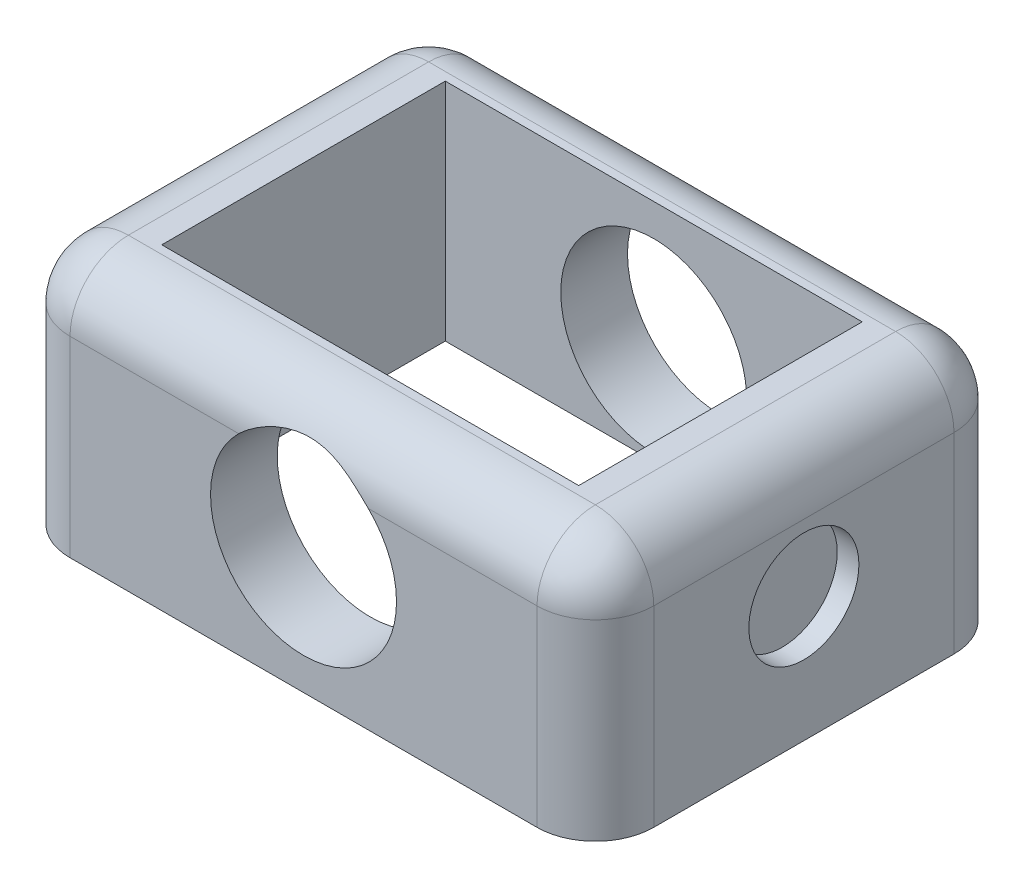
ISO-10303-21;
HEADER;
FILE_DESCRIPTION(('STEP AP214'),'2;1');
FILE_NAME('part.step','',(''),(''),'','','');
FILE_SCHEMA(('AUTOMOTIVE_DESIGN { 1 0 10303 214 1 1 1 1 }'));
ENDSEC;
DATA;
#1=APPLICATION_CONTEXT('core data for automotive mechanical design processes');
#2=APPLICATION_PROTOCOL_DEFINITION('international standard','automotive_design',2000,#1);
#3=PRODUCT_CONTEXT('',#1,'mechanical');
#4=PRODUCT('Part','Part','',(#3));
#5=PRODUCT_RELATED_PRODUCT_CATEGORY('part','',(#4));
#6=PRODUCT_DEFINITION_FORMATION('','',#4);
#7=PRODUCT_DEFINITION_CONTEXT('part definition',#1,'design');
#8=PRODUCT_DEFINITION('design','',#6,#7);
#9=PRODUCT_DEFINITION_SHAPE('','',#8);
#10=(LENGTH_UNIT() NAMED_UNIT(*) SI_UNIT(.MILLI.,.METRE.));
#11=(NAMED_UNIT(*) PLANE_ANGLE_UNIT() SI_UNIT($,.RADIAN.));
#12=(NAMED_UNIT(*) SI_UNIT($,.STERADIAN.) SOLID_ANGLE_UNIT());
#13=UNCERTAINTY_MEASURE_WITH_UNIT(LENGTH_MEASURE(1.E-05),#10,'distance_accuracy_value','');
#14=(GEOMETRIC_REPRESENTATION_CONTEXT(3) GLOBAL_UNCERTAINTY_ASSIGNED_CONTEXT((#13)) GLOBAL_UNIT_ASSIGNED_CONTEXT((#10,
#11,#12)) REPRESENTATION_CONTEXT('',''));
#15=CARTESIAN_POINT('',(0.,0.,0.));
#16=DIRECTION('',(0.,0.,1.));
#17=DIRECTION('',(1.,0.,0.));
#18=AXIS2_PLACEMENT_3D('',#15,#16,#17);
#19=CARTESIAN_POINT('',(35.,15.,25.));
#20=DIRECTION('',(-1.,0.,0.));
#21=DIRECTION('',(0.,0.,1.));
#22=AXIS2_PLACEMENT_3D('',#19,#20,#21);
#23=PLANE('',#22);
#24=CARTESIAN_POINT('',(35.,0.,0.));
#25=DIRECTION('',(1.,0.,0.));
#26=DIRECTION('',(0.,0.,-1.));
#27=AXIS2_PLACEMENT_3D('',#24,#25,#26);
#28=CIRCLE('',#27,6.6);
#29=CARTESIAN_POINT('',(35.,0.,-6.6));
#30=VERTEX_POINT('',#29);
#31=EDGE_CURVE('E699',#30,#30,#28,.T.);
#32=ORIENTED_EDGE('',*,*,#31,.F.);
#33=EDGE_LOOP('',(#32));
#34=FACE_BOUND('',#33,.T.);
#35=DIRECTION('',(0.,0.,-1.));
#36=VECTOR('',#35,1.);
#37=CARTESIAN_POINT('',(35.,8.,25.));
#38=LINE('',#37,#36);
#39=CARTESIAN_POINT('',(35.,8.,-18.));
#40=VERTEX_POINT('',#39);
#41=CARTESIAN_POINT('',(35.,8.,18.));
#42=VERTEX_POINT('',#41);
#43=EDGE_CURVE('E205',#40,#42,#38,.F.);
#44=ORIENTED_EDGE('',*,*,#43,.T.);
#45=DIRECTION('',(0.,-1.,0.));
#46=VECTOR('',#45,1.);
#47=CARTESIAN_POINT('',(35.,15.,18.));
#48=LINE('',#47,#46);
#49=CARTESIAN_POINT('',(35.,-15.,18.));
#50=VERTEX_POINT('',#49);
#51=EDGE_CURVE('E209',#42,#50,#48,.T.);
#52=ORIENTED_EDGE('',*,*,#51,.T.);
#53=DIRECTION('',(0.,0.,-1.));
#54=VECTOR('',#53,1.);
#55=CARTESIAN_POINT('',(35.,-15.,25.));
#56=LINE('',#55,#54);
#57=CARTESIAN_POINT('',(35.,-15.,-18.));
#58=VERTEX_POINT('',#57);
#59=EDGE_CURVE('E324',#50,#58,#56,.T.);
#60=ORIENTED_EDGE('',*,*,#59,.T.);
#61=DIRECTION('',(0.,-1.,0.));
#62=VECTOR('',#61,1.);
#63=CARTESIAN_POINT('',(35.,15.,-18.));
#64=LINE('',#63,#62);
#65=EDGE_CURVE('E207',#58,#40,#64,.F.);
#66=ORIENTED_EDGE('',*,*,#65,.T.);
#67=EDGE_LOOP('',(#44,#52,#60,#66));
#68=FACE_BOUND('',#67,.T.);
#69=ADVANCED_FACE('F33',(#34,#68),#23,.F.);
#70=CARTESIAN_POINT('',(-35.,15.,-25.));
#71=DIRECTION('',(0.,0.,1.));
#72=DIRECTION('',(1.,0.,0.));
#73=AXIS2_PLACEMENT_3D('',#70,#71,#72);
#74=PLANE('',#73);
#75=DIRECTION('',(-1.,0.,0.));
#76=VECTOR('',#75,1.);
#77=CARTESIAN_POINT('',(-35.,8.,-25.));
#78=LINE('',#77,#76);
#79=CARTESIAN_POINT('',(-28.,8.,-25.));
#80=VERTEX_POINT('',#79);
#81=CARTESIAN_POINT('',(-7.76675607959977,8.,-25.));
#82=VERTEX_POINT('',#81);
#83=EDGE_CURVE('E212',#80,#82,#78,.F.);
#84=ORIENTED_EDGE('',*,*,#83,.T.);
#85=CARTESIAN_POINT('',(0.,0.,-25.));
#86=DIRECTION('',(0.,0.,1.));
#87=DIRECTION('',(1.,0.,0.));
#88=AXIS2_PLACEMENT_3D('',#85,#86,#87);
#89=CIRCLE('',#88,11.15);
#90=CARTESIAN_POINT('',(7.76675607959977,8.,-25.));
#91=VERTEX_POINT('',#90);
#92=EDGE_CURVE('E53',#82,#91,#89,.T.);
#93=ORIENTED_EDGE('',*,*,#92,.T.);
#94=CARTESIAN_POINT('',(28.,8.,-25.));
#95=VERTEX_POINT('',#94);
#96=EDGE_CURVE('E211',#91,#95,#78,.F.);
#97=ORIENTED_EDGE('',*,*,#96,.T.);
#98=DIRECTION('',(0.,-1.,0.));
#99=VECTOR('',#98,1.);
#100=CARTESIAN_POINT('',(28.,15.,-25.));
#101=LINE('',#100,#99);
#102=CARTESIAN_POINT('',(28.,-15.,-25.));
#103=VERTEX_POINT('',#102);
#104=EDGE_CURVE('E217',#95,#103,#101,.T.);
#105=ORIENTED_EDGE('',*,*,#104,.T.);
#106=DIRECTION('',(-1.,0.,0.));
#107=VECTOR('',#106,1.);
#108=CARTESIAN_POINT('',(-35.,-15.,-25.));
#109=LINE('',#108,#107);
#110=CARTESIAN_POINT('',(-28.,-15.,-25.));
#111=VERTEX_POINT('',#110);
#112=EDGE_CURVE('E327',#103,#111,#109,.T.);
#113=ORIENTED_EDGE('',*,*,#112,.T.);
#114=DIRECTION('',(0.,-1.,0.));
#115=VECTOR('',#114,1.);
#116=CARTESIAN_POINT('',(-28.,15.,-25.));
#117=LINE('',#116,#115);
#118=EDGE_CURVE('E215',#111,#80,#117,.F.);
#119=ORIENTED_EDGE('',*,*,#118,.T.);
#120=EDGE_LOOP('',(#84,#93,#97,#105,#113,#119));
#121=FACE_BOUND('',#120,.T.);
#122=ADVANCED_FACE('F384',(#121),#74,.F.);
#123=CARTESIAN_POINT('',(-35.,15.,25.));
#124=DIRECTION('',(1.,0.,0.));
#125=DIRECTION('',(0.,0.,-1.));
#126=AXIS2_PLACEMENT_3D('',#123,#124,#125);
#127=PLANE('',#126);
#128=CARTESIAN_POINT('',(-35.,0.,0.));
#129=DIRECTION('',(1.,0.,0.));
#130=DIRECTION('',(0.,0.,-1.));
#131=AXIS2_PLACEMENT_3D('',#128,#129,#130);
#132=CIRCLE('',#131,6.6);
#133=CARTESIAN_POINT('',(-35.,0.,-6.6));
#134=VERTEX_POINT('',#133);
#135=EDGE_CURVE('E705',#134,#134,#132,.T.);
#136=ORIENTED_EDGE('',*,*,#135,.T.);
#137=EDGE_LOOP('',(#136));
#138=FACE_BOUND('',#137,.T.);
#139=DIRECTION('',(0.,0.,1.));
#140=VECTOR('',#139,1.);
#141=CARTESIAN_POINT('',(-35.,-15.,25.));
#142=LINE('',#141,#140);
#143=CARTESIAN_POINT('',(-35.,-15.,-18.));
#144=VERTEX_POINT('',#143);
#145=CARTESIAN_POINT('',(-35.,-15.,18.));
#146=VERTEX_POINT('',#145);
#147=EDGE_CURVE('E184',#144,#146,#142,.T.);
#148=ORIENTED_EDGE('',*,*,#147,.T.);
#149=DIRECTION('',(0.,-1.,0.));
#150=VECTOR('',#149,1.);
#151=CARTESIAN_POINT('',(-35.,15.,18.));
#152=LINE('',#151,#150);
#153=CARTESIAN_POINT('',(-35.,8.,18.));
#154=VERTEX_POINT('',#153);
#155=EDGE_CURVE('E203',#146,#154,#152,.F.);
#156=ORIENTED_EDGE('',*,*,#155,.T.);
#157=DIRECTION('',(0.,0.,1.));
#158=VECTOR('',#157,1.);
#159=CARTESIAN_POINT('',(-35.,8.,25.));
#160=LINE('',#159,#158);
#161=CARTESIAN_POINT('',(-35.,8.,-18.));
#162=VERTEX_POINT('',#161);
#163=EDGE_CURVE('E199',#154,#162,#160,.F.);
#164=ORIENTED_EDGE('',*,*,#163,.T.);
#165=DIRECTION('',(0.,-1.,0.));
#166=VECTOR('',#165,1.);
#167=CARTESIAN_POINT('',(-35.,15.,-18.));
#168=LINE('',#167,#166);
#169=EDGE_CURVE('E201',#162,#144,#168,.T.);
#170=ORIENTED_EDGE('',*,*,#169,.T.);
#171=EDGE_LOOP('',(#148,#156,#164,#170));
#172=FACE_BOUND('',#171,.T.);
#173=ADVANCED_FACE('F344',(#138,#172),#127,.F.);
#174=CARTESIAN_POINT('',(-35.,15.,25.));
#175=DIRECTION('',(0.,0.,-1.));
#176=DIRECTION('',(-1.,0.,0.));
#177=AXIS2_PLACEMENT_3D('',#174,#175,#176);
#178=PLANE('',#177);
#179=DIRECTION('',(1.,0.,0.));
#180=VECTOR('',#179,1.);
#181=CARTESIAN_POINT('',(-35.,8.,25.));
#182=LINE('',#181,#180);
#183=CARTESIAN_POINT('',(28.,8.,25.));
#184=VERTEX_POINT('',#183);
#185=CARTESIAN_POINT('',(7.76675607959977,8.,25.));
#186=VERTEX_POINT('',#185);
#187=EDGE_CURVE('E171',#184,#186,#182,.F.);
#188=ORIENTED_EDGE('',*,*,#187,.T.);
#189=CARTESIAN_POINT('',(0.,0.,25.));
#190=DIRECTION('',(0.,0.,-1.));
#191=DIRECTION('',(-1.,0.,0.));
#192=AXIS2_PLACEMENT_3D('',#189,#190,#191);
#193=CIRCLE('',#192,11.15);
#194=CARTESIAN_POINT('',(-7.76675607959977,8.,25.));
#195=VERTEX_POINT('',#194);
#196=EDGE_CURVE('E59',#186,#195,#193,.T.);
#197=ORIENTED_EDGE('',*,*,#196,.T.);
#198=CARTESIAN_POINT('',(-28.,8.,25.));
#199=VERTEX_POINT('',#198);
#200=EDGE_CURVE('E169',#195,#199,#182,.F.);
#201=ORIENTED_EDGE('',*,*,#200,.T.);
#202=DIRECTION('',(0.,-1.,0.));
#203=VECTOR('',#202,1.);
#204=CARTESIAN_POINT('',(-28.,15.,25.));
#205=LINE('',#204,#203);
#206=CARTESIAN_POINT('',(-28.,-15.,25.));
#207=VERTEX_POINT('',#206);
#208=EDGE_CURVE('E189',#199,#207,#205,.T.);
#209=ORIENTED_EDGE('',*,*,#208,.T.);
#210=DIRECTION('',(1.,0.,0.));
#211=VECTOR('',#210,1.);
#212=CARTESIAN_POINT('',(-35.,-15.,25.));
#213=LINE('',#212,#211);
#214=CARTESIAN_POINT('',(28.,-15.,25.));
#215=VERTEX_POINT('',#214);
#216=EDGE_CURVE('E180',#207,#215,#213,.T.);
#217=ORIENTED_EDGE('',*,*,#216,.T.);
#218=DIRECTION('',(0.,-1.,0.));
#219=VECTOR('',#218,1.);
#220=CARTESIAN_POINT('',(28.,15.,25.));
#221=LINE('',#220,#219);
#222=EDGE_CURVE('E182',#215,#184,#221,.F.);
#223=ORIENTED_EDGE('',*,*,#222,.T.);
#224=EDGE_LOOP('',(#188,#197,#201,#209,#217,#223));
#225=FACE_BOUND('',#224,.T.);
#226=ADVANCED_FACE('F167',(#225),#178,.F.);
#227=CARTESIAN_POINT('',(0.,15.,0.));
#228=DIRECTION('',(0.,-1.,0.));
#229=DIRECTION('',(0.,0.,-1.));
#230=AXIS2_PLACEMENT_3D('',#227,#228,#229);
#231=PLANE('',#230);
#232=DIRECTION('',(0.,0.,-1.));
#233=VECTOR('',#232,1.);
#234=CARTESIAN_POINT('',(28.,15.,0.));
#235=LINE('',#234,#233);
#236=CARTESIAN_POINT('',(28.,15.,18.));
#237=VERTEX_POINT('',#236);
#238=CARTESIAN_POINT('',(28.,15.,-18.));
#239=VERTEX_POINT('',#238);
#240=EDGE_CURVE('E223',#237,#239,#235,.T.);
#241=ORIENTED_EDGE('',*,*,#240,.T.);
#242=DIRECTION('',(-1.,0.,0.));
#243=VECTOR('',#242,1.);
#244=CARTESIAN_POINT('',(0.,15.,-18.));
#245=LINE('',#244,#243);
#246=CARTESIAN_POINT('',(-28.,15.,-18.));
#247=VERTEX_POINT('',#246);
#248=EDGE_CURVE('E225',#239,#247,#245,.T.);
#249=ORIENTED_EDGE('',*,*,#248,.T.);
#250=DIRECTION('',(0.,0.,1.));
#251=VECTOR('',#250,1.);
#252=CARTESIAN_POINT('',(-28.,15.,0.));
#253=LINE('',#252,#251);
#254=CARTESIAN_POINT('',(-28.,15.,18.));
#255=VERTEX_POINT('',#254);
#256=EDGE_CURVE('E221',#247,#255,#253,.T.);
#257=ORIENTED_EDGE('',*,*,#256,.T.);
#258=DIRECTION('',(1.,0.,0.));
#259=VECTOR('',#258,1.);
#260=CARTESIAN_POINT('',(0.,15.,18.));
#261=LINE('',#260,#259);
#262=EDGE_CURVE('E219',#255,#237,#261,.T.);
#263=ORIENTED_EDGE('',*,*,#262,.T.);
#264=EDGE_LOOP('',(#241,#249,#257,#263));
#265=FACE_BOUND('',#264,.T.);
#266=DIRECTION('',(1.,0.,0.));
#267=VECTOR('',#266,1.);
#268=CARTESIAN_POINT('',(-25.,15.,-17.));
#269=LINE('',#268,#267);
#270=CARTESIAN_POINT('',(-25.,15.,-17.));
#271=VERTEX_POINT('',#270);
#272=CARTESIAN_POINT('',(25.,15.,-17.));
#273=VERTEX_POINT('',#272);
#274=EDGE_CURVE('E332',#271,#273,#269,.T.);
#275=ORIENTED_EDGE('',*,*,#274,.T.);
#276=DIRECTION('',(0.,0.,1.));
#277=VECTOR('',#276,1.);
#278=CARTESIAN_POINT('',(25.,15.,-17.));
#279=LINE('',#278,#277);
#280=CARTESIAN_POINT('',(25.,15.,17.));
#281=VERTEX_POINT('',#280);
#282=EDGE_CURVE('E264',#273,#281,#279,.T.);
#283=ORIENTED_EDGE('',*,*,#282,.T.);
#284=DIRECTION('',(-1.,0.,0.));
#285=VECTOR('',#284,1.);
#286=CARTESIAN_POINT('',(-25.,15.,17.));
#287=LINE('',#286,#285);
#288=CARTESIAN_POINT('',(-25.,15.,17.));
#289=VERTEX_POINT('',#288);
#290=EDGE_CURVE('E689',#281,#289,#287,.T.);
#291=ORIENTED_EDGE('',*,*,#290,.T.);
#292=DIRECTION('',(0.,0.,-1.));
#293=VECTOR('',#292,1.);
#294=CARTESIAN_POINT('',(-25.,15.,-17.));
#295=LINE('',#294,#293);
#296=EDGE_CURVE('E691',#289,#271,#295,.T.);
#297=ORIENTED_EDGE('',*,*,#296,.T.);
#298=EDGE_LOOP('',(#275,#283,#291,#297));
#299=FACE_BOUND('',#298,.T.);
#300=ADVANCED_FACE('F369',(#265,#299),#231,.F.);
#301=CARTESIAN_POINT('',(0.,-15.,0.));
#302=DIRECTION('',(0.,-1.,0.));
#303=DIRECTION('',(0.,0.,-1.));
#304=AXIS2_PLACEMENT_3D('',#301,#302,#303);
#305=PLANE('',#304);
#306=DIRECTION('',(0.,0.,-1.));
#307=VECTOR('',#306,1.);
#308=CARTESIAN_POINT('',(28.,-15.,-17.));
#309=LINE('',#308,#307);
#310=CARTESIAN_POINT('',(28.,-15.,20.));
#311=VERTEX_POINT('',#310);
#312=CARTESIAN_POINT('',(28.,-15.,-20.));
#313=VERTEX_POINT('',#312);
#314=EDGE_CURVE('E267',#311,#313,#309,.T.);
#315=ORIENTED_EDGE('',*,*,#314,.T.);
#316=DIRECTION('',(-1.,0.,0.));
#317=VECTOR('',#316,1.);
#318=CARTESIAN_POINT('',(-25.,-15.,-20.));
#319=LINE('',#318,#317);
#320=CARTESIAN_POINT('',(-28.,-15.,-20.));
#321=VERTEX_POINT('',#320);
#322=EDGE_CURVE('E273',#313,#321,#319,.T.);
#323=ORIENTED_EDGE('',*,*,#322,.T.);
#324=DIRECTION('',(0.,0.,1.));
#325=VECTOR('',#324,1.);
#326=CARTESIAN_POINT('',(-28.,-15.,17.));
#327=LINE('',#326,#325);
#328=CARTESIAN_POINT('',(-28.,-15.,20.));
#329=VERTEX_POINT('',#328);
#330=EDGE_CURVE('E271',#321,#329,#327,.T.);
#331=ORIENTED_EDGE('',*,*,#330,.T.);
#332=DIRECTION('',(1.,0.,0.));
#333=VECTOR('',#332,1.);
#334=CARTESIAN_POINT('',(25.,-15.,20.));
#335=LINE('',#334,#333);
#336=EDGE_CURVE('E269',#329,#311,#335,.T.);
#337=ORIENTED_EDGE('',*,*,#336,.T.);
#338=EDGE_LOOP('',(#315,#323,#331,#337));
#339=FACE_BOUND('',#338,.T.);
#340=ORIENTED_EDGE('',*,*,#216,.F.);
#341=CARTESIAN_POINT('',(-28.,-15.,18.));
#342=DIRECTION('',(0.,-1.,0.));
#343=DIRECTION('',(0.,0.,-1.));
#344=AXIS2_PLACEMENT_3D('',#341,#342,#343);
#345=CIRCLE('',#344,7.);
#346=EDGE_CURVE('E197',#207,#146,#345,.T.);
#347=ORIENTED_EDGE('',*,*,#346,.T.);
#348=ORIENTED_EDGE('',*,*,#147,.F.);
#349=CARTESIAN_POINT('',(-28.,-15.,-18.));
#350=DIRECTION('',(0.,-1.,0.));
#351=DIRECTION('',(0.,0.,-1.));
#352=AXIS2_PLACEMENT_3D('',#349,#350,#351);
#353=CIRCLE('',#352,7.);
#354=EDGE_CURVE('E191',#144,#111,#353,.T.);
#355=ORIENTED_EDGE('',*,*,#354,.T.);
#356=ORIENTED_EDGE('',*,*,#112,.F.);
#357=CARTESIAN_POINT('',(28.,-15.,-18.));
#358=DIRECTION('',(0.,-1.,0.));
#359=DIRECTION('',(0.,0.,-1.));
#360=AXIS2_PLACEMENT_3D('',#357,#358,#359);
#361=CIRCLE('',#360,7.);
#362=EDGE_CURVE('E193',#103,#58,#361,.T.);
#363=ORIENTED_EDGE('',*,*,#362,.T.);
#364=ORIENTED_EDGE('',*,*,#59,.F.);
#365=CARTESIAN_POINT('',(28.,-15.,18.));
#366=DIRECTION('',(0.,-1.,0.));
#367=DIRECTION('',(0.,0.,-1.));
#368=AXIS2_PLACEMENT_3D('',#365,#366,#367);
#369=CIRCLE('',#368,7.);
#370=EDGE_CURVE('E195',#50,#215,#369,.T.);
#371=ORIENTED_EDGE('',*,*,#370,.T.);
#372=EDGE_LOOP('',(#340,#347,#348,#355,#356,#363,#364,#371));
#373=FACE_BOUND('',#372,.T.);
#374=ADVANCED_FACE('F301',(#339,#373),#305,.T.);
#375=CARTESIAN_POINT('',(25.,15.,-17.));
#376=DIRECTION('',(1.,0.,0.));
#377=DIRECTION('',(0.,0.,-1.));
#378=AXIS2_PLACEMENT_3D('',#375,#376,#377);
#379=PLANE('',#378);
#380=DIRECTION('',(0.,-1.,0.));
#381=VECTOR('',#380,1.);
#382=CARTESIAN_POINT('',(25.,15.,-17.));
#383=LINE('',#382,#381);
#384=CARTESIAN_POINT('',(25.,-12.,-17.));
#385=VERTEX_POINT('',#384);
#386=EDGE_CURVE('E318',#273,#385,#383,.T.);
#387=ORIENTED_EDGE('',*,*,#386,.T.);
#388=DIRECTION('',(0.,0.,1.));
#389=VECTOR('',#388,1.);
#390=CARTESIAN_POINT('',(25.,-12.,17.));
#391=LINE('',#390,#389);
#392=CARTESIAN_POINT('',(25.,-12.,17.));
#393=VERTEX_POINT('',#392);
#394=EDGE_CURVE('E47',#385,#393,#391,.T.);
#395=ORIENTED_EDGE('',*,*,#394,.T.);
#396=DIRECTION('',(0.,-1.,0.));
#397=VECTOR('',#396,1.);
#398=CARTESIAN_POINT('',(25.,15.,17.));
#399=LINE('',#398,#397);
#400=EDGE_CURVE('E337',#281,#393,#399,.T.);
#401=ORIENTED_EDGE('',*,*,#400,.F.);
#402=ORIENTED_EDGE('',*,*,#282,.F.);
#403=EDGE_LOOP('',(#387,#395,#401,#402));
#404=FACE_BOUND('',#403,.T.);
#405=ADVANCED_FACE('F321',(#404),#379,.F.);
#406=CARTESIAN_POINT('',(-25.,15.,-17.));
#407=DIRECTION('',(0.,0.,-1.));
#408=DIRECTION('',(-1.,0.,0.));
#409=AXIS2_PLACEMENT_3D('',#406,#407,#408);
#410=PLANE('',#409);
#411=CARTESIAN_POINT('',(0.,0.,-17.));
#412=DIRECTION('',(0.,0.,-1.));
#413=DIRECTION('',(-1.,0.,0.));
#414=AXIS2_PLACEMENT_3D('',#411,#412,#413);
#415=CIRCLE('',#414,11.15);
#416=CARTESIAN_POINT('',(-11.15,0.,-17.));
#417=VERTEX_POINT('',#416);
#418=EDGE_CURVE('E284',#417,#417,#415,.T.);
#419=ORIENTED_EDGE('',*,*,#418,.T.);
#420=EDGE_LOOP('',(#419));
#421=FACE_BOUND('',#420,.T.);
#422=DIRECTION('',(0.,-1.,0.));
#423=VECTOR('',#422,1.);
#424=CARTESIAN_POINT('',(-25.,15.,-17.));
#425=LINE('',#424,#423);
#426=CARTESIAN_POINT('',(-25.,-12.,-17.));
#427=VERTEX_POINT('',#426);
#428=EDGE_CURVE('E320',#271,#427,#425,.T.);
#429=ORIENTED_EDGE('',*,*,#428,.T.);
#430=DIRECTION('',(1.,0.,0.));
#431=VECTOR('',#430,1.);
#432=CARTESIAN_POINT('',(25.,-12.,-17.));
#433=LINE('',#432,#431);
#434=EDGE_CURVE('E228',#427,#385,#433,.T.);
#435=ORIENTED_EDGE('',*,*,#434,.T.);
#436=ORIENTED_EDGE('',*,*,#386,.F.);
#437=ORIENTED_EDGE('',*,*,#274,.F.);
#438=EDGE_LOOP('',(#429,#435,#436,#437));
#439=FACE_BOUND('',#438,.T.);
#440=ADVANCED_FACE('F316',(#421,#439),#410,.F.);
#441=CARTESIAN_POINT('',(-25.,15.,-17.));
#442=DIRECTION('',(-1.,0.,0.));
#443=DIRECTION('',(0.,0.,1.));
#444=AXIS2_PLACEMENT_3D('',#441,#442,#443);
#445=PLANE('',#444);
#446=DIRECTION('',(0.,-1.,0.));
#447=VECTOR('',#446,1.);
#448=CARTESIAN_POINT('',(-25.,15.,17.));
#449=LINE('',#448,#447);
#450=CARTESIAN_POINT('',(-25.,-12.,17.));
#451=VERTEX_POINT('',#450);
#452=EDGE_CURVE('E329',#289,#451,#449,.T.);
#453=ORIENTED_EDGE('',*,*,#452,.T.);
#454=DIRECTION('',(0.,0.,-1.));
#455=VECTOR('',#454,1.);
#456=CARTESIAN_POINT('',(-25.,-12.,-17.));
#457=LINE('',#456,#455);
#458=EDGE_CURVE('E276',#451,#427,#457,.T.);
#459=ORIENTED_EDGE('',*,*,#458,.T.);
#460=ORIENTED_EDGE('',*,*,#428,.F.);
#461=ORIENTED_EDGE('',*,*,#296,.F.);
#462=EDGE_LOOP('',(#453,#459,#460,#461));
#463=FACE_BOUND('',#462,.T.);
#464=ADVANCED_FACE('F597',(#463),#445,.F.);
#465=CARTESIAN_POINT('',(-25.,15.,17.));
#466=DIRECTION('',(0.,0.,1.));
#467=DIRECTION('',(1.,0.,0.));
#468=AXIS2_PLACEMENT_3D('',#465,#466,#467);
#469=PLANE('',#468);
#470=CARTESIAN_POINT('',(0.,0.,17.));
#471=DIRECTION('',(0.,0.,1.));
#472=DIRECTION('',(1.,0.,0.));
#473=AXIS2_PLACEMENT_3D('',#470,#471,#472);
#474=CIRCLE('',#473,11.15);
#475=CARTESIAN_POINT('',(11.15,0.,17.));
#476=VERTEX_POINT('',#475);
#477=EDGE_CURVE('E683',#476,#476,#474,.T.);
#478=ORIENTED_EDGE('',*,*,#477,.T.);
#479=EDGE_LOOP('',(#478));
#480=FACE_BOUND('',#479,.T.);
#481=ORIENTED_EDGE('',*,*,#400,.T.);
#482=DIRECTION('',(-1.,0.,0.));
#483=VECTOR('',#482,1.);
#484=CARTESIAN_POINT('',(-25.,-12.,17.));
#485=LINE('',#484,#483);
#486=EDGE_CURVE('E278',#393,#451,#485,.T.);
#487=ORIENTED_EDGE('',*,*,#486,.T.);
#488=ORIENTED_EDGE('',*,*,#452,.F.);
#489=ORIENTED_EDGE('',*,*,#290,.F.);
#490=EDGE_LOOP('',(#481,#487,#488,#489));
#491=FACE_BOUND('',#490,.T.);
#492=ADVANCED_FACE('F589',(#480,#491),#469,.F.);
#493=CARTESIAN_POINT('',(28.,15.,-18.));
#494=DIRECTION('',(0.,-1.,0.));
#495=DIRECTION('',(0.,0.,-1.));
#496=AXIS2_PLACEMENT_3D('',#493,#494,#495);
#497=CYLINDRICAL_SURFACE('',#496,7.);
#498=CARTESIAN_POINT('',(28.,8.,-18.));
#499=DIRECTION('',(0.,1.,0.));
#500=DIRECTION('',(0.,0.,1.));
#501=AXIS2_PLACEMENT_3D('',#498,#499,#500);
#502=CIRCLE('',#501,7.);
#503=EDGE_CURVE('E261',#40,#95,#502,.T.);
#504=ORIENTED_EDGE('',*,*,#503,.F.);
#505=ORIENTED_EDGE('',*,*,#65,.F.);
#506=ORIENTED_EDGE('',*,*,#362,.F.);
#507=ORIENTED_EDGE('',*,*,#104,.F.);
#508=EDGE_LOOP('',(#504,#505,#506,#507));
#509=FACE_BOUND('',#508,.T.);
#510=ADVANCED_FACE('F388',(#509),#497,.T.);
#511=CARTESIAN_POINT('',(28.,8.,-18.));
#512=DIRECTION('',(0.,0.,1.));
#513=DIRECTION('',(1.,0.,0.));
#514=AXIS2_PLACEMENT_3D('',#511,#512,#513);
#515=SPHERICAL_SURFACE('',#514,7.);
#516=CARTESIAN_POINT('',(28.,8.,-18.));
#517=DIRECTION('',(0.,0.,-1.));
#518=DIRECTION('',(-1.,0.,0.));
#519=AXIS2_PLACEMENT_3D('',#516,#517,#518);
#520=CIRCLE('',#519,7.);
#521=EDGE_CURVE('E255',#40,#239,#520,.F.);
#522=ORIENTED_EDGE('',*,*,#521,.F.);
#523=ORIENTED_EDGE('',*,*,#503,.T.);
#524=CARTESIAN_POINT('',(28.,8.,-18.));
#525=DIRECTION('',(1.,0.,0.));
#526=DIRECTION('',(0.,1.,0.));
#527=AXIS2_PLACEMENT_3D('',#524,#525,#526);
#528=CIRCLE('',#527,7.);
#529=EDGE_CURVE('E258',#239,#95,#528,.F.);
#530=ORIENTED_EDGE('',*,*,#529,.F.);
#531=EDGE_LOOP('',(#522,#523,#530));
#532=FACE_BOUND('',#531,.T.);
#533=ADVANCED_FACE('F379',(#532),#515,.T.);
#534=CARTESIAN_POINT('',(-28.,15.,-18.));
#535=DIRECTION('',(0.,-1.,0.));
#536=DIRECTION('',(0.,0.,-1.));
#537=AXIS2_PLACEMENT_3D('',#534,#535,#536);
#538=CYLINDRICAL_SURFACE('',#537,7.);
#539=ORIENTED_EDGE('',*,*,#354,.F.);
#540=ORIENTED_EDGE('',*,*,#169,.F.);
#541=CARTESIAN_POINT('',(-28.,8.,-18.));
#542=DIRECTION('',(0.,1.,0.));
#543=DIRECTION('',(0.,0.,1.));
#544=AXIS2_PLACEMENT_3D('',#541,#542,#543);
#545=CIRCLE('',#544,7.);
#546=EDGE_CURVE('E252',#80,#162,#545,.T.);
#547=ORIENTED_EDGE('',*,*,#546,.F.);
#548=ORIENTED_EDGE('',*,*,#118,.F.);
#549=EDGE_LOOP('',(#539,#540,#547,#548));
#550=FACE_BOUND('',#549,.T.);
#551=ADVANCED_FACE('F359',(#550),#538,.T.);
#552=CARTESIAN_POINT('',(0.,8.,-18.));
#553=DIRECTION('',(-1.,0.,0.));
#554=DIRECTION('',(0.,0.,1.));
#555=AXIS2_PLACEMENT_3D('',#552,#553,#554);
#556=CYLINDRICAL_SURFACE('',#555,7.);
#557=CARTESIAN_POINT('',(-7.76675607959977,8.,-25.));
#558=CARTESIAN_POINT('',(-7.55263561819045,8.20793839637741,-24.9999640947775));
#559=CARTESIAN_POINT('',(-7.33029039609794,8.40704093546171,-24.990740150009));
#560=CARTESIAN_POINT('',(-6.87127516960229,8.7861419102596,-24.9583212699517));
#561=CARTESIAN_POINT('',(-6.63462455722676,8.96616533593562,-24.935144882441));
#562=CARTESIAN_POINT('',(-6.14867266505549,9.30614464473174,-24.8792174762288));
#563=CARTESIAN_POINT('',(-5.89937806476026,9.46611097157785,-24.8464714702607));
#564=CARTESIAN_POINT('',(-5.38938765481347,9.7654716082529,-24.7754547535623));
#565=CARTESIAN_POINT('',(-5.12868806717674,9.90485903324785,-24.7371822023152));
#566=CARTESIAN_POINT('',(-4.60485651548705,10.1587443380555,-24.6600989519508));
#567=CARTESIAN_POINT('',(-4.34200648885732,10.2738391956208,-24.6213348124083));
#568=CARTESIAN_POINT('',(-3.80802393235849,10.483496956612,-24.5455840654034));
#569=CARTESIAN_POINT('',(-3.53689251101712,10.5780625944102,-24.5085972217271));
#570=CARTESIAN_POINT('',(-2.98775756785112,10.746077280628,-24.4395120834127));
#571=CARTESIAN_POINT('',(-2.70975926349841,10.8195418563698,-24.4074102023721));
#572=CARTESIAN_POINT('',(-2.14815037723464,10.9448950516286,-24.3507741174471));
#573=CARTESIAN_POINT('',(-1.86453953190358,10.9967826559203,-24.3262402696629));
#574=CARTESIAN_POINT('',(-1.27181688171655,11.0815719283455,-24.2854060297872));
#575=CARTESIAN_POINT('',(-0.962400448799439,11.1127381497082,-24.2698698885227));
#576=CARTESIAN_POINT('',(-0.341652985681366,11.149100153539,-24.2516867664712));
#577=CARTESIAN_POINT('',(-0.0303219178023162,11.1542954232768,-24.249040040153));
#578=CARTESIAN_POINT('',(0.591652528464856,11.1386386135356,-24.2569177881961));
#579=CARTESIAN_POINT('',(0.902295528755911,11.1177746614526,-24.2674482661072));
#580=CARTESIAN_POINT('',(1.52009438950052,11.0502660071253,-24.3005776055677));
#581=CARTESIAN_POINT('',(1.82725029345213,11.0036216268276,-24.3231763164086));
#582=CARTESIAN_POINT('',(2.40874968707717,10.8903741852171,-24.3756761266391));
#583=CARTESIAN_POINT('',(2.68358881017903,10.8259061220455,-24.4047526341252));
#584=CARTESIAN_POINT('',(3.22695684077303,10.6765460662084,-24.4685926932064));
#585=CARTESIAN_POINT('',(3.4954860672495,10.5916551084308,-24.5033559566085));
#586=CARTESIAN_POINT('',(4.02490964049176,10.4020022289843,-24.5757642891754));
#587=CARTESIAN_POINT('',(4.28580661879933,10.2972472517541,-24.6134083484823));
#588=CARTESIAN_POINT('',(4.79896593084733,10.0683341964052,-24.6885350668251));
#589=CARTESIAN_POINT('',(5.05122856289301,9.94417678944128,-24.7260177313977));
#590=CARTESIAN_POINT('',(5.52265737900731,9.68956054807283,-24.794193968608));
#591=CARTESIAN_POINT('',(5.74269936892864,9.5608039939557,-24.8251944001564));
#592=CARTESIAN_POINT('',(6.17387376815298,9.28820883618951,-24.8818521782188));
#593=CARTESIAN_POINT('',(6.3850090926788,9.14437522194901,-24.9075112839821));
#594=CARTESIAN_POINT('',(6.7977013523051,8.84190135936656,-24.9508690468751));
#595=CARTESIAN_POINT('',(6.99924658158807,8.68324368255202,-24.9685581879355));
#596=CARTESIAN_POINT('',(7.3914989416988,8.35190949288523,-24.9931200001078));
#597=CARTESIAN_POINT('',(7.58219446067462,8.17921842345422,-24.9999812851283));
#598=CARTESIAN_POINT('',(7.76675607959977,8.,-25.));
#599=B_SPLINE_CURVE_WITH_KNOTS('',3,(#557,#558,#559,#560,#561,#562,#563,#564,#565,#566,#567,
#568,#569,#570,#571,#572,#573,#574,#575,#576,#577,#578,#579,#580,#581,#582,#583,#584,#585,#586,
#587,#588,#589,#590,#591,#592,#593,#594,#595,#596,#597,#598),.UNSPECIFIED.,.F.,.F.,(4,2,2,2,2,2,
2,2,2,2,2,2,2,2,2,2,2,2,2,2,4),(0.,0.894675361023923,1.78816399728374,2.68118544492911,
3.57450498619392,4.44232045103788,5.31002025691079,6.17707991609041,7.04418036697142,
7.9769484250746,8.90973489822942,9.84294650476656,10.7761464576004,11.6266482809943,
12.4771070160476,13.327268978014,14.1774015382999,14.9472526002751,15.7168496971487,
16.4873632669273,17.2586865358624),.UNSPECIFIED.);
#600=EDGE_CURVE('E172',#82,#91,#599,.T.);
#601=ORIENTED_EDGE('',*,*,#600,.F.);
#602=ORIENTED_EDGE('',*,*,#83,.F.);
#603=CARTESIAN_POINT('',(-28.,8.,-18.));
#604=DIRECTION('',(-1.,0.,0.));
#605=DIRECTION('',(0.,0.,1.));
#606=AXIS2_PLACEMENT_3D('',#603,#604,#605);
#607=CIRCLE('',#606,7.);
#608=EDGE_CURVE('E249',#247,#80,#607,.T.);
#609=ORIENTED_EDGE('',*,*,#608,.F.);
#610=ORIENTED_EDGE('',*,*,#248,.F.);
#611=ORIENTED_EDGE('',*,*,#529,.T.);
#612=ORIENTED_EDGE('',*,*,#96,.F.);
#613=EDGE_LOOP('',(#601,#602,#609,#610,#611,#612));
#614=FACE_BOUND('',#613,.T.);
#615=ADVANCED_FACE('F367',(#614),#556,.T.);
#616=CARTESIAN_POINT('',(28.,8.,0.));
#617=DIRECTION('',(0.,0.,-1.));
#618=DIRECTION('',(-1.,0.,0.));
#619=AXIS2_PLACEMENT_3D('',#616,#617,#618);
#620=CYLINDRICAL_SURFACE('',#619,7.);
#621=ORIENTED_EDGE('',*,*,#521,.T.);
#622=ORIENTED_EDGE('',*,*,#240,.F.);
#623=CARTESIAN_POINT('',(28.,8.,18.));
#624=DIRECTION('',(0.,0.,1.));
#625=DIRECTION('',(1.,0.,0.));
#626=AXIS2_PLACEMENT_3D('',#623,#624,#625);
#627=CIRCLE('',#626,7.);
#628=EDGE_CURVE('E246',#42,#237,#627,.T.);
#629=ORIENTED_EDGE('',*,*,#628,.F.);
#630=ORIENTED_EDGE('',*,*,#43,.F.);
#631=EDGE_LOOP('',(#621,#622,#629,#630));
#632=FACE_BOUND('',#631,.T.);
#633=ADVANCED_FACE('F377',(#632),#620,.T.);
#634=CARTESIAN_POINT('',(28.,15.,18.));
#635=DIRECTION('',(0.,-1.,0.));
#636=DIRECTION('',(0.,0.,-1.));
#637=AXIS2_PLACEMENT_3D('',#634,#635,#636);
#638=CYLINDRICAL_SURFACE('',#637,7.);
#639=ORIENTED_EDGE('',*,*,#370,.F.);
#640=ORIENTED_EDGE('',*,*,#51,.F.);
#641=CARTESIAN_POINT('',(28.,8.,18.));
#642=DIRECTION('',(0.,1.,0.));
#643=DIRECTION('',(0.,0.,1.));
#644=AXIS2_PLACEMENT_3D('',#641,#642,#643);
#645=CIRCLE('',#644,7.);
#646=EDGE_CURVE('E243',#184,#42,#645,.T.);
#647=ORIENTED_EDGE('',*,*,#646,.F.);
#648=ORIENTED_EDGE('',*,*,#222,.F.);
#649=EDGE_LOOP('',(#639,#640,#647,#648));
#650=FACE_BOUND('',#649,.T.);
#651=ADVANCED_FACE('F397',(#650),#638,.T.);
#652=CARTESIAN_POINT('',(-28.,8.,-18.));
#653=DIRECTION('',(0.,0.,1.));
#654=DIRECTION('',(1.,0.,0.));
#655=AXIS2_PLACEMENT_3D('',#652,#653,#654);
#656=SPHERICAL_SURFACE('',#655,7.);
#657=ORIENTED_EDGE('',*,*,#608,.T.);
#658=ORIENTED_EDGE('',*,*,#546,.T.);
#659=CARTESIAN_POINT('',(-28.,8.,-18.));
#660=DIRECTION('',(0.,0.,-1.));
#661=DIRECTION('',(-1.,0.,0.));
#662=AXIS2_PLACEMENT_3D('',#659,#660,#661);
#663=CIRCLE('',#662,7.);
#664=EDGE_CURVE('E240',#247,#162,#663,.F.);
#665=ORIENTED_EDGE('',*,*,#664,.F.);
#666=EDGE_LOOP('',(#657,#658,#665));
#667=FACE_BOUND('',#666,.T.);
#668=ADVANCED_FACE('F362',(#667),#656,.T.);
#669=CARTESIAN_POINT('',(28.,8.,18.));
#670=DIRECTION('',(0.,0.,1.));
#671=DIRECTION('',(1.,0.,0.));
#672=AXIS2_PLACEMENT_3D('',#669,#670,#671);
#673=SPHERICAL_SURFACE('',#672,7.);
#674=ORIENTED_EDGE('',*,*,#646,.T.);
#675=ORIENTED_EDGE('',*,*,#628,.T.);
#676=CARTESIAN_POINT('',(28.,8.,18.));
#677=DIRECTION('',(1.,0.,0.));
#678=DIRECTION('',(0.,0.,-1.));
#679=AXIS2_PLACEMENT_3D('',#676,#677,#678);
#680=CIRCLE('',#679,7.);
#681=EDGE_CURVE('E237',#184,#237,#680,.F.);
#682=ORIENTED_EDGE('',*,*,#681,.F.);
#683=EDGE_LOOP('',(#674,#675,#682));
#684=FACE_BOUND('',#683,.T.);
#685=ADVANCED_FACE('F401',(#684),#673,.T.);
#686=CARTESIAN_POINT('',(-28.,8.,0.));
#687=DIRECTION('',(0.,0.,1.));
#688=DIRECTION('',(1.,0.,0.));
#689=AXIS2_PLACEMENT_3D('',#686,#687,#688);
#690=CYLINDRICAL_SURFACE('',#689,7.);
#691=ORIENTED_EDGE('',*,*,#664,.T.);
#692=ORIENTED_EDGE('',*,*,#163,.F.);
#693=CARTESIAN_POINT('',(-28.,8.,18.));
#694=DIRECTION('',(0.,0.,1.));
#695=DIRECTION('',(1.,0.,0.));
#696=AXIS2_PLACEMENT_3D('',#693,#694,#695);
#697=CIRCLE('',#696,7.);
#698=EDGE_CURVE('E234',#255,#154,#697,.T.);
#699=ORIENTED_EDGE('',*,*,#698,.F.);
#700=ORIENTED_EDGE('',*,*,#256,.F.);
#701=EDGE_LOOP('',(#691,#692,#699,#700));
#702=FACE_BOUND('',#701,.T.);
#703=ADVANCED_FACE('F355',(#702),#690,.T.);
#704=CARTESIAN_POINT('',(0.,8.,18.));
#705=DIRECTION('',(1.,0.,0.));
#706=DIRECTION('',(0.,0.,-1.));
#707=AXIS2_PLACEMENT_3D('',#704,#705,#706);
#708=CYLINDRICAL_SURFACE('',#707,7.);
#709=CARTESIAN_POINT('',(7.76675607959977,8.,25.));
#710=CARTESIAN_POINT('',(7.55263561819045,8.20793839637741,24.9999640947775));
#711=CARTESIAN_POINT('',(7.33029039609794,8.40704093546171,24.990740150009));
#712=CARTESIAN_POINT('',(6.87127516960229,8.7861419102596,24.9583212699518));
#713=CARTESIAN_POINT('',(6.63462455722676,8.96616533593562,24.935144882441));
#714=CARTESIAN_POINT('',(6.14867266505549,9.30614464473174,24.8792174762288));
#715=CARTESIAN_POINT('',(5.89937806476026,9.46611097157785,24.8464714702607));
#716=CARTESIAN_POINT('',(5.38938765481347,9.76547160825289,24.7754547535623));
#717=CARTESIAN_POINT('',(5.12868806717674,9.90485903324785,24.7371822023153));
#718=CARTESIAN_POINT('',(4.60485651548705,10.1587443380555,24.6600989519509));
#719=CARTESIAN_POINT('',(4.34200648885732,10.2738391956208,24.6213348124084));
#720=CARTESIAN_POINT('',(3.80802393235849,10.483496956612,24.5455840654034));
#721=CARTESIAN_POINT('',(3.53689251101712,10.5780625944102,24.5085972217271));
#722=CARTESIAN_POINT('',(2.98775756785112,10.746077280628,24.4395120834127));
#723=CARTESIAN_POINT('',(2.70975926349841,10.8195418563698,24.4074102023721));
#724=CARTESIAN_POINT('',(2.14815037723464,10.9448950516286,24.3507741174471));
#725=CARTESIAN_POINT('',(1.86453953190358,10.9967826559203,24.3262402696629));
#726=CARTESIAN_POINT('',(1.27181688171655,11.0815719283455,24.2854060297872));
#727=CARTESIAN_POINT('',(0.962400448799439,11.1127381497082,24.2698698885227));
#728=CARTESIAN_POINT('',(0.341652985681366,11.149100153539,24.2516867664712));
#729=CARTESIAN_POINT('',(0.0303219178023162,11.1542954232768,24.249040040153));
#730=CARTESIAN_POINT('',(-0.591652528464856,11.1386386135356,24.2569177881961));
#731=CARTESIAN_POINT('',(-0.902295528755911,11.1177746614526,24.2674482661072));
#732=CARTESIAN_POINT('',(-1.52009438950052,11.0502660071253,24.3005776055677));
#733=CARTESIAN_POINT('',(-1.82725029345213,11.0036216268276,24.3231763164087));
#734=CARTESIAN_POINT('',(-2.40874968707717,10.8903741852171,24.3756761266391));
#735=CARTESIAN_POINT('',(-2.68358881017903,10.8259061220455,24.4047526341252));
#736=CARTESIAN_POINT('',(-3.22695684077303,10.6765460662084,24.4685926932064));
#737=CARTESIAN_POINT('',(-3.4954860672495,10.5916551084308,24.5033559566085));
#738=CARTESIAN_POINT('',(-4.02490964049176,10.4020022289843,24.5757642891754));
#739=CARTESIAN_POINT('',(-4.28580661879933,10.2972472517541,24.6134083484824));
#740=CARTESIAN_POINT('',(-4.79896593084733,10.0683341964052,24.6885350668251));
#741=CARTESIAN_POINT('',(-5.05122856289301,9.94417678944128,24.7260177313977));
#742=CARTESIAN_POINT('',(-5.52265737900731,9.68956054807283,24.794193968608));
#743=CARTESIAN_POINT('',(-5.74269936892864,9.5608039939557,24.8251944001564));
#744=CARTESIAN_POINT('',(-6.17387376815298,9.28820883618951,24.8818521782188));
#745=CARTESIAN_POINT('',(-6.3850090926788,9.14437522194901,24.9075112839821));
#746=CARTESIAN_POINT('',(-6.7977013523051,8.84190135936656,24.9508690468751));
#747=CARTESIAN_POINT('',(-6.99924658158807,8.68324368255202,24.9685581879355));
#748=CARTESIAN_POINT('',(-7.3914989416988,8.35190949288523,24.9931200001078));
#749=CARTESIAN_POINT('',(-7.58219446067462,8.17921842345422,24.9999812851283));
#750=CARTESIAN_POINT('',(-7.76675607959977,8.,25.));
#751=B_SPLINE_CURVE_WITH_KNOTS('',3,(#709,#710,#711,#712,#713,#714,#715,#716,#717,#718,#719,
#720,#721,#722,#723,#724,#725,#726,#727,#728,#729,#730,#731,#732,#733,#734,#735,#736,#737,#738,
#739,#740,#741,#742,#743,#744,#745,#746,#747,#748,#749,#750),.UNSPECIFIED.,.F.,.F.,(4,2,2,2,2,2,
2,2,2,2,2,2,2,2,2,2,2,2,2,2,4),(0.,0.894675361023923,1.78816399728374,2.68118544492911,
3.57450498619392,4.44232045103788,5.31002025691079,6.17707991609041,7.04418036697142,
7.9769484250746,8.90973489822942,9.84294650476656,10.7761464576004,11.6266482809943,
12.4771070160476,13.327268978014,14.1774015382999,14.9472526002751,15.7168496971487,
16.4873632669273,17.2586865358624),.UNSPECIFIED.);
#752=EDGE_CURVE('E11',#186,#195,#751,.T.);
#753=ORIENTED_EDGE('',*,*,#752,.F.);
#754=ORIENTED_EDGE('',*,*,#187,.F.);
#755=ORIENTED_EDGE('',*,*,#681,.T.);
#756=ORIENTED_EDGE('',*,*,#262,.F.);
#757=CARTESIAN_POINT('',(-28.,8.,18.));
#758=DIRECTION('',(-1.,0.,0.));
#759=DIRECTION('',(0.,0.,1.));
#760=AXIS2_PLACEMENT_3D('',#757,#758,#759);
#761=CIRCLE('',#760,7.);
#762=EDGE_CURVE('E178',#199,#255,#761,.T.);
#763=ORIENTED_EDGE('',*,*,#762,.F.);
#764=ORIENTED_EDGE('',*,*,#200,.F.);
#765=EDGE_LOOP('',(#753,#754,#755,#756,#763,#764));
#766=FACE_BOUND('',#765,.T.);
#767=ADVANCED_FACE('F175',(#766),#708,.T.);
#768=CARTESIAN_POINT('',(-28.,8.,18.));
#769=DIRECTION('',(0.,0.,1.));
#770=DIRECTION('',(1.,0.,0.));
#771=AXIS2_PLACEMENT_3D('',#768,#769,#770);
#772=SPHERICAL_SURFACE('',#771,7.);
#773=ORIENTED_EDGE('',*,*,#762,.T.);
#774=ORIENTED_EDGE('',*,*,#698,.T.);
#775=CARTESIAN_POINT('',(-28.,8.,18.));
#776=DIRECTION('',(0.,1.,0.));
#777=DIRECTION('',(0.,0.,1.));
#778=AXIS2_PLACEMENT_3D('',#775,#776,#777);
#779=CIRCLE('',#778,7.);
#780=EDGE_CURVE('E229',#199,#154,#779,.F.);
#781=ORIENTED_EDGE('',*,*,#780,.F.);
#782=EDGE_LOOP('',(#773,#774,#781));
#783=FACE_BOUND('',#782,.T.);
#784=ADVANCED_FACE('F352',(#783),#772,.T.);
#785=CARTESIAN_POINT('',(-28.,15.,18.));
#786=DIRECTION('',(0.,-1.,0.));
#787=DIRECTION('',(0.,0.,-1.));
#788=AXIS2_PLACEMENT_3D('',#785,#786,#787);
#789=CYLINDRICAL_SURFACE('',#788,7.);
#790=ORIENTED_EDGE('',*,*,#780,.T.);
#791=ORIENTED_EDGE('',*,*,#155,.F.);
#792=ORIENTED_EDGE('',*,*,#346,.F.);
#793=ORIENTED_EDGE('',*,*,#208,.F.);
#794=EDGE_LOOP('',(#790,#791,#792,#793));
#795=FACE_BOUND('',#794,.T.);
#796=ADVANCED_FACE('F349',(#795),#789,.T.);
#797=CARTESIAN_POINT('',(-25.,-12.,17.));
#798=DIRECTION('',(0.,-0.707106781186549,-0.707106781186546));
#799=DIRECTION('',(1.,0.,0.));
#800=AXIS2_PLACEMENT_3D('',#797,#798,#799);
#801=PLANE('',#800);
#802=DIRECTION('',(-0.577350269189627,0.577350269189624,-0.577350269189627));
#803=VECTOR('',#802,1.);
#804=CARTESIAN_POINT('',(8.33333333333328,4.66666666666664,0.333333333333293));
#805=LINE('',#804,#803);
#806=EDGE_CURVE('E286',#311,#393,#805,.T.);
#807=ORIENTED_EDGE('',*,*,#806,.F.);
#808=ORIENTED_EDGE('',*,*,#336,.F.);
#809=DIRECTION('',(0.577350269189627,0.577350269189624,-0.577350269189627));
#810=VECTOR('',#809,1.);
#811=CARTESIAN_POINT('',(-13.6666666666666,-0.666666666666677,5.66666666666664));
#812=LINE('',#811,#810);
#813=EDGE_CURVE('E232',#451,#329,#812,.F.);
#814=ORIENTED_EDGE('',*,*,#813,.F.);
#815=ORIENTED_EDGE('',*,*,#486,.F.);
#816=EDGE_LOOP('',(#807,#808,#814,#815));
#817=FACE_BOUND('',#816,.T.);
#818=ADVANCED_FACE('F35',(#817),#801,.T.);
#819=CARTESIAN_POINT('',(-25.,-12.,-17.));
#820=DIRECTION('',(0.707106781186546,-0.707106781186549,0.));
#821=DIRECTION('',(0.,0.,1.));
#822=AXIS2_PLACEMENT_3D('',#819,#820,#821);
#823=PLANE('',#822);
#824=ORIENTED_EDGE('',*,*,#813,.T.);
#825=ORIENTED_EDGE('',*,*,#330,.F.);
#826=DIRECTION('',(0.577350269189627,0.577350269189624,0.577350269189627));
#827=VECTOR('',#826,1.);
#828=CARTESIAN_POINT('',(-25.,-12.,-17.));
#829=LINE('',#828,#827);
#830=EDGE_CURVE('E283',#427,#321,#829,.F.);
#831=ORIENTED_EDGE('',*,*,#830,.F.);
#832=ORIENTED_EDGE('',*,*,#458,.F.);
#833=EDGE_LOOP('',(#824,#825,#831,#832));
#834=FACE_BOUND('',#833,.T.);
#835=ADVANCED_FACE('F293',(#834),#823,.T.);
#836=CARTESIAN_POINT('',(25.,-12.,-17.));
#837=DIRECTION('',(-0.707106781186546,-0.707106781186549,0.));
#838=DIRECTION('',(0.,0.,-1.));
#839=AXIS2_PLACEMENT_3D('',#836,#837,#838);
#840=PLANE('',#839);
#841=ORIENTED_EDGE('',*,*,#806,.T.);
#842=ORIENTED_EDGE('',*,*,#394,.F.);
#843=DIRECTION('',(0.577350269189627,-0.577350269189624,-0.577350269189627));
#844=VECTOR('',#843,1.);
#845=CARTESIAN_POINT('',(8.33333333333328,4.66666666666664,-0.333333333333293));
#846=LINE('',#845,#844);
#847=EDGE_CURVE('E281',#313,#385,#846,.F.);
#848=ORIENTED_EDGE('',*,*,#847,.F.);
#849=ORIENTED_EDGE('',*,*,#314,.F.);
#850=EDGE_LOOP('',(#841,#842,#848,#849));
#851=FACE_BOUND('',#850,.T.);
#852=ADVANCED_FACE('F310',(#851),#840,.T.);
#853=CARTESIAN_POINT('',(-25.,-12.,-17.));
#854=DIRECTION('',(0.,-0.707106781186549,0.707106781186546));
#855=DIRECTION('',(-1.,0.,0.));
#856=AXIS2_PLACEMENT_3D('',#853,#854,#855);
#857=PLANE('',#856);
#858=ORIENTED_EDGE('',*,*,#830,.T.);
#859=ORIENTED_EDGE('',*,*,#322,.F.);
#860=ORIENTED_EDGE('',*,*,#847,.T.);
#861=ORIENTED_EDGE('',*,*,#434,.F.);
#862=EDGE_LOOP('',(#858,#859,#860,#861));
#863=FACE_BOUND('',#862,.T.);
#864=ADVANCED_FACE('F306',(#863),#857,.T.);
#865=CARTESIAN_POINT('',(0.,0.,25.));
#866=DIRECTION('',(0.,0.,-1.));
#867=DIRECTION('',(-1.,0.,0.));
#868=AXIS2_PLACEMENT_3D('',#865,#866,#867);
#869=CYLINDRICAL_SURFACE('',#868,11.15);
#870=ORIENTED_EDGE('',*,*,#752,.T.);
#871=ORIENTED_EDGE('',*,*,#196,.F.);
#872=EDGE_LOOP('',(#870,#871));
#873=FACE_BOUND('',#872,.T.);
#874=ORIENTED_EDGE('',*,*,#477,.F.);
#875=EDGE_LOOP('',(#874));
#876=FACE_BOUND('',#875,.T.);
#877=ADVANCED_FACE('F160',(#873,#876),#869,.F.);
#878=ORIENTED_EDGE('',*,*,#600,.T.);
#879=ORIENTED_EDGE('',*,*,#92,.F.);
#880=EDGE_LOOP('',(#878,#879));
#881=FACE_BOUND('',#880,.T.);
#882=ORIENTED_EDGE('',*,*,#418,.F.);
#883=EDGE_LOOP('',(#882));
#884=FACE_BOUND('',#883,.T.);
#885=ADVANCED_FACE('F469',(#881,#884),#869,.F.);
#886=CARTESIAN_POINT('',(32.4,0.,0.));
#887=DIRECTION('',(1.,0.,0.));
#888=DIRECTION('',(0.,0.,-1.));
#889=AXIS2_PLACEMENT_3D('',#886,#887,#888);
#890=CYLINDRICAL_SURFACE('',#889,6.6);
#891=CARTESIAN_POINT('',(32.4,0.,0.));
#892=DIRECTION('',(1.,0.,0.));
#893=DIRECTION('',(0.,0.,-1.));
#894=AXIS2_PLACEMENT_3D('',#891,#892,#893);
#895=CIRCLE('',#894,6.6);
#896=CARTESIAN_POINT('',(32.4,0.,-6.6));
#897=VERTEX_POINT('',#896);
#898=EDGE_CURVE('E173',#897,#897,#895,.T.);
#899=ORIENTED_EDGE('',*,*,#898,.F.);
#900=EDGE_LOOP('',(#899));
#901=FACE_BOUND('',#900,.T.);
#902=ORIENTED_EDGE('',*,*,#31,.T.);
#903=EDGE_LOOP('',(#902));
#904=FACE_BOUND('',#903,.T.);
#905=ADVANCED_FACE('F475',(#901,#904),#890,.F.);
#906=CARTESIAN_POINT('',(32.4,0.,0.));
#907=DIRECTION('',(1.,0.,0.));
#908=DIRECTION('',(0.,0.,-1.));
#909=AXIS2_PLACEMENT_3D('',#906,#907,#908);
#910=PLANE('',#909);
#911=ORIENTED_EDGE('',*,*,#898,.T.);
#912=EDGE_LOOP('',(#911));
#913=FACE_BOUND('',#912,.T.);
#914=ADVANCED_FACE('F481',(#913),#910,.T.);
#915=CARTESIAN_POINT('',(-32.4,0.,0.));
#916=DIRECTION('',(-1.,0.,0.));
#917=DIRECTION('',(0.,0.,1.));
#918=AXIS2_PLACEMENT_3D('',#915,#916,#917);
#919=CYLINDRICAL_SURFACE('',#918,6.6);
#920=CARTESIAN_POINT('',(-32.4,0.,0.));
#921=DIRECTION('',(1.,0.,0.));
#922=DIRECTION('',(0.,0.,-1.));
#923=AXIS2_PLACEMENT_3D('',#920,#921,#922);
#924=CIRCLE('',#923,6.6);
#925=CARTESIAN_POINT('',(-32.4,0.,-6.6));
#926=VERTEX_POINT('',#925);
#927=EDGE_CURVE('E702',#926,#926,#924,.T.);
#928=ORIENTED_EDGE('',*,*,#927,.T.);
#929=EDGE_LOOP('',(#928));
#930=FACE_BOUND('',#929,.T.);
#931=ORIENTED_EDGE('',*,*,#135,.F.);
#932=EDGE_LOOP('',(#931));
#933=FACE_BOUND('',#932,.T.);
#934=ADVANCED_FACE('F489',(#930,#933),#919,.F.);
#935=CARTESIAN_POINT('',(-32.4,0.,0.));
#936=DIRECTION('',(-1.,0.,0.));
#937=DIRECTION('',(0.,0.,-1.));
#938=AXIS2_PLACEMENT_3D('',#935,#936,#937);
#939=PLANE('',#938);
#940=ORIENTED_EDGE('',*,*,#927,.F.);
#941=EDGE_LOOP('',(#940));
#942=FACE_BOUND('',#941,.T.);
#943=ADVANCED_FACE('F498',(#942),#939,.T.);
#944=CLOSED_SHELL('',(#69,#122,#173,#226,#300,#374,#405,#440,#464,#492,#510,#533,#551,#615,#633,
#651,#668,#685,#703,#767,#784,#796,#818,#835,#852,#864,#877,#885,#905,#914,#934,#943));
#945=MANIFOLD_SOLID_BREP('B2',#944);
#946=ADVANCED_BREP_SHAPE_REPRESENTATION('',(#18,#945),#14);
#947=SHAPE_DEFINITION_REPRESENTATION(#9,#946);
ENDSEC;
END-ISO-10303-21;
